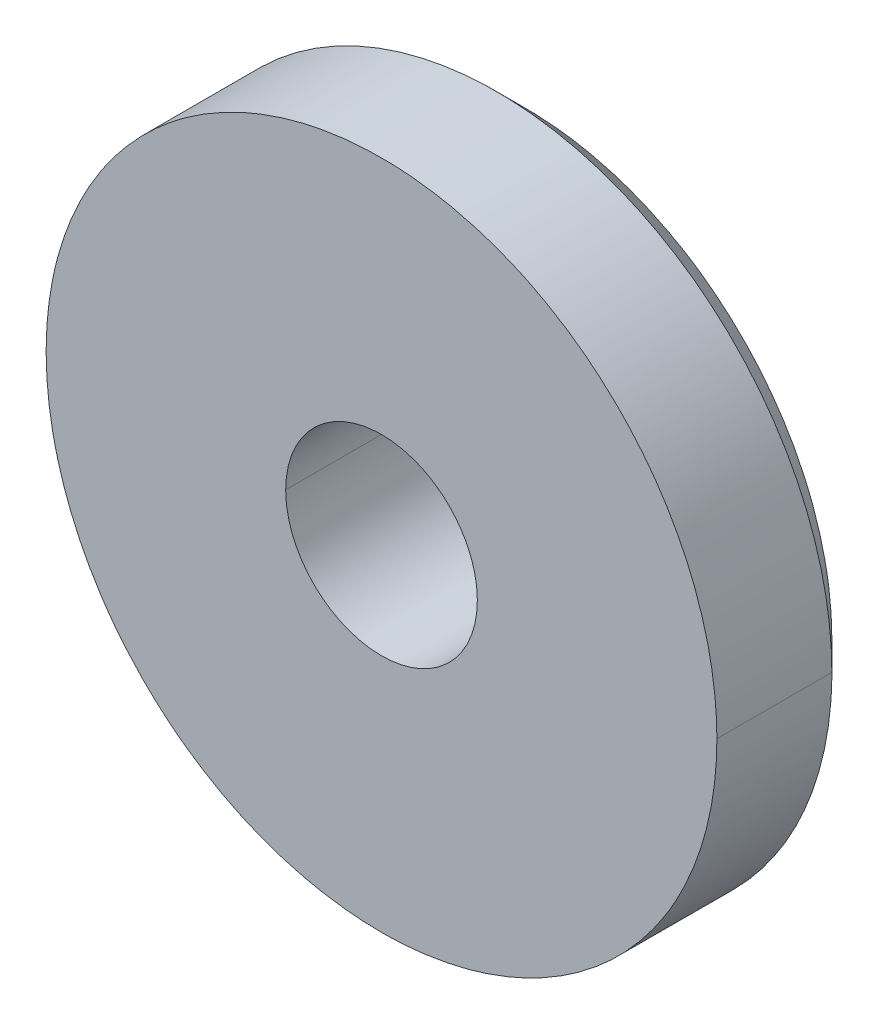
ISO-10303-21;
HEADER;
FILE_DESCRIPTION(('STEP AP214'),'2;1');
FILE_NAME('part.step','',(''),(''),'','','');
FILE_SCHEMA(('AUTOMOTIVE_DESIGN { 1 0 10303 214 1 1 1 1 }'));
ENDSEC;
DATA;
#1=APPLICATION_CONTEXT('core data for automotive mechanical design processes');
#2=APPLICATION_PROTOCOL_DEFINITION('international standard','automotive_design',2000,#1);
#3=PRODUCT_CONTEXT('',#1,'mechanical');
#4=PRODUCT('Part','Part','',(#3));
#5=PRODUCT_RELATED_PRODUCT_CATEGORY('part','',(#4));
#6=PRODUCT_DEFINITION_FORMATION('','',#4);
#7=PRODUCT_DEFINITION_CONTEXT('part definition',#1,'design');
#8=PRODUCT_DEFINITION('design','',#6,#7);
#9=PRODUCT_DEFINITION_SHAPE('','',#8);
#10=(LENGTH_UNIT() NAMED_UNIT(*) SI_UNIT(.MILLI.,.METRE.));
#11=(NAMED_UNIT(*) PLANE_ANGLE_UNIT() SI_UNIT($,.RADIAN.));
#12=(NAMED_UNIT(*) SI_UNIT($,.STERADIAN.) SOLID_ANGLE_UNIT());
#13=UNCERTAINTY_MEASURE_WITH_UNIT(LENGTH_MEASURE(1.E-05),#10,'distance_accuracy_value','');
#14=(GEOMETRIC_REPRESENTATION_CONTEXT(3) GLOBAL_UNCERTAINTY_ASSIGNED_CONTEXT((#13)) GLOBAL_UNIT_ASSIGNED_CONTEXT((#10,
#11,#12)) REPRESENTATION_CONTEXT('',''));
#15=CARTESIAN_POINT('',(0.,0.,0.));
#16=DIRECTION('',(0.,0.,1.));
#17=DIRECTION('',(1.,0.,0.));
#18=AXIS2_PLACEMENT_3D('',#15,#16,#17);
#19=CARTESIAN_POINT('',(10.8868969336,-4.1764018894,3.48920000018));
#20=CARTESIAN_POINT('',(10.8868969336,-4.1764018894,3.782));
#21=CARTESIAN_POINT('',(10.8868969336,-3.90810987678,3.48920000018));
#22=CARTESIAN_POINT('',(10.8868969336,-3.90810987678,3.782));
#23=CARTESIAN_POINT('',(10.7818421201,-3.63956754597,3.48920000018));
#24=CARTESIAN_POINT('',(10.7818421201,-3.63956754597,3.782));
#25=CARTESIAN_POINT('',(10.5694809588,-3.42745670286,3.48920000018));
#26=CARTESIAN_POINT('',(10.5694809588,-3.42745670286,3.782));
#27=CARTESIAN_POINT('',(10.0328969336,-3.21734707595,3.48920000018));
#28=CARTESIAN_POINT('',(10.0328969336,-3.21734707595,3.782));
#29=CARTESIAN_POINT('',(9.49631290836,-3.42745670286,3.48920000018));
#30=CARTESIAN_POINT('',(9.49631290836,-3.42745670286,3.782));
#31=CARTESIAN_POINT('',(9.28395174705,-3.63956754597,3.48920000018));
#32=CARTESIAN_POINT('',(9.28395174705,-3.63956754597,3.782));
#33=CARTESIAN_POINT('',(9.17889693359,-3.90810987678,3.48920000018));
#34=CARTESIAN_POINT('',(9.17889693359,-3.90810987678,3.782));
#35=CARTESIAN_POINT('',(9.17889693359,-4.1764018894,3.48920000018));
#36=CARTESIAN_POINT('',(9.17889693359,-4.1764018894,3.782));
#37=B_SPLINE_SURFACE_WITH_KNOTS('',5,1,((#19,#20),(#21,#22),(#23,#24),(#25,#26),(#27,#28),(#29,
#30),(#31,#32),(#33,#34),(#35,#36)),.UNSPECIFIED.,.F.,.F.,.F.,(6,3,6),(2,2),(0.,5.49778714378,
10.9955742876),(0.300000000745,1.5),.UNSPECIFIED.);
#38=DIRECTION('',(0.,0.,1.));
#39=VECTOR('',#38,1.);
#40=CARTESIAN_POINT('',(9.17889693359,-4.1764018894,3.63560000009));
#41=LINE('',#40,#39);
#42=CARTESIAN_POINT('',(9.17889693359,-4.1764018894,3.489200000045));
#43=VERTEX_POINT('',#42);
#44=CARTESIAN_POINT('',(9.17889693359,-4.1764018894,3.782));
#45=VERTEX_POINT('',#44);
#46=EDGE_CURVE('E75',#43,#45,#41,.T.);
#47=CARTESIAN_POINT('',(9.17889693359,-4.1764018894,3.782));
#48=CARTESIAN_POINT('',(9.1788968461694,-4.15235985944562,3.782));
#49=CARTESIAN_POINT('',(9.17990994533691,-4.12832904131958,3.782));
#50=CARTESIAN_POINT('',(9.18395582748908,-4.08043890881535,3.782));
#51=CARTESIAN_POINT('',(9.18698854411785,-4.05657958882852,3.782));
#52=CARTESIAN_POINT('',(9.19909232082522,-3.98556146459147,3.782));
#53=CARTESIAN_POINT('',(9.21116906498144,-3.93887894903747,3.782));
#54=CARTESIAN_POINT('',(9.24298935548476,-3.84825981784746,3.782));
#55=CARTESIAN_POINT('',(9.26272880210373,-3.80432174843615,3.782));
#56=CARTESIAN_POINT('',(9.3092991360481,-3.72038520706849,3.782));
#57=CARTESIAN_POINT('',(9.33612857725198,-3.68038593401064,3.782));
#58=CARTESIAN_POINT('',(9.39611845983409,-3.60543802382516,3.782));
#59=CARTESIAN_POINT('',(9.42928092219787,-3.5704910052385,3.782));
#60=CARTESIAN_POINT('',(9.50099274331696,-3.50664679755722,3.782));
#61=CARTESIAN_POINT('',(9.53954200716781,-3.47774950190119,3.782));
#62=CARTESIAN_POINT('',(9.62103533427206,-3.42677001504506,3.782));
#63=CARTESIAN_POINT('',(9.66398964312181,-3.40470421463178,3.782));
#64=CARTESIAN_POINT('',(9.75296681564455,-3.36814393490239,3.782));
#65=CARTESIAN_POINT('',(9.79898605009083,-3.35364067429222,3.782));
#66=CARTESIAN_POINT('',(9.87707945820086,-3.33611001647814,3.782));
#67=CARTESIAN_POINT('',(9.90867422395629,-3.33086725227736,3.782));
#68=CARTESIAN_POINT('',(9.97225353703094,-3.32395326782138,3.782));
#69=CARTESIAN_POINT('',(10.0042381067352,-3.3222822536602,3.782));
#70=CARTESIAN_POINT('',(10.0842260954729,-3.32259759038582,3.782));
#71=CARTESIAN_POINT('',(10.1322381043473,-3.32683194259491,3.782));
#72=CARTESIAN_POINT('',(10.2268988749132,-3.34332096015035,3.782));
#73=CARTESIAN_POINT('',(10.2735462328523,-3.3555836003539,3.782));
#74=CARTESIAN_POINT('',(10.3640085802533,-3.38774726832448,3.782));
#75=CARTESIAN_POINT('',(10.4078299523462,-3.40763032476163,3.782));
#76=CARTESIAN_POINT('',(10.4915897049965,-3.4545012472007,3.782));
#77=CARTESIAN_POINT('',(10.5315212882688,-3.48150125528685,3.782));
#78=CARTESIAN_POINT('',(10.6063115352315,-3.54182892999676,3.782));
#79=CARTESIAN_POINT('',(10.6411675889247,-3.57515983200744,3.782));
#80=CARTESIAN_POINT('',(10.7047415094042,-3.64713539252712,3.782));
#81=CARTESIAN_POINT('',(10.73346972253,-3.68577091036449,3.782));
#82=CARTESIAN_POINT('',(10.7841092330087,-3.76741756016027,3.782));
#83=CARTESIAN_POINT('',(10.8060020871634,-3.8104401218487,3.782));
#84=CARTESIAN_POINT('',(10.8422207749767,-3.89955177670138,3.782));
#85=CARTESIAN_POINT('',(10.8565507437698,-3.94563917855797,3.782));
#86=CARTESIAN_POINT('',(10.8735494355992,-4.02275840026495,3.782));
#87=CARTESIAN_POINT('',(10.8785545431009,-4.05329550320001,3.782));
#88=CARTESIAN_POINT('',(10.885227902855,-4.11468498411831,3.782));
#89=CARTESIAN_POINT('',(10.8869012402069,-4.14553680930108,3.782));
#90=CARTESIAN_POINT('',(10.8868969336,-4.17640188921999,3.782));
#91=B_SPLINE_CURVE_WITH_KNOTS('',3,(#47,#48,#49,#50,#51,#52,#53,#54,#55,#56,#57,#58,#59,#60,#61,
#62,#63,#64,#65,#66,#67,#68,#69,#70,#71,#72,#73,#74,#75,#76,#77,#78,#79,#80,#81,#82,#83,#84,#85,
#86,#87,#88,#89,#90),.UNSPECIFIED.,.F.,.F.,(4,2,2,2,2,2,2,2,2,2,2,2,2,2,2,2,2,2,2,2,2,4),(0.,
0.0720822714207288,0.144162174646541,0.288074538934495,0.431910012568474,0.575716171195146,
0.719568297977,0.86341789069701,1.00760999342903,1.15163429158194,1.24752587920709,
1.34342299973629,1.48729684855349,1.6313138309792,1.77499324556325,1.91891939329721,
2.06291929298456,2.20667410205743,2.35081350433184,2.49487401410583,2.58753910892514,
2.68006266530655),.UNSPECIFIED.);
#92=CARTESIAN_POINT('',(10.8868969336,-4.17640188931,3.782));
#93=VERTEX_POINT('',#92);
#94=EDGE_CURVE('E23',#45,#93,#91,.T.);
#95=DIRECTION('',(0.,0.,-1.));
#96=VECTOR('',#95,1.);
#97=CARTESIAN_POINT('',(10.8868969336,-4.1764018894,3.63560000009));
#98=LINE('',#97,#96);
#99=CARTESIAN_POINT('',(10.8868969336,-4.1764018894,3.489200000045));
#100=VERTEX_POINT('',#99);
#101=EDGE_CURVE('E65',#93,#100,#98,.T.);
#102=CARTESIAN_POINT('',(10.8868969336,-4.1764018894,3.4892));
#103=CARTESIAN_POINT('',(10.8868969336,-3.90810987678,3.4892));
#104=CARTESIAN_POINT('',(10.7818421201,-3.63956754597,3.4892));
#105=CARTESIAN_POINT('',(10.5694809588,-3.42745670286,3.4892));
#106=CARTESIAN_POINT('',(10.0328969336,-3.21734707595,3.4892));
#107=CARTESIAN_POINT('',(9.49631290836,-3.42745670286,3.4892));
#108=CARTESIAN_POINT('',(9.28395174705,-3.63956754597,3.4892));
#109=CARTESIAN_POINT('',(9.17889693359,-3.90810987678,3.4892));
#110=CARTESIAN_POINT('',(9.17889693359,-4.1764018894,3.4892));
#111=B_SPLINE_CURVE_WITH_KNOTS('',5,(#102,#103,#104,#105,#106,#107,#108,#109,#110),
.UNSPECIFIED.,.F.,.F.,(6,3,6),(0.,157.079632679,314.159265359),.UNSPECIFIED.);
#112=EDGE_CURVE('E74',#43,#100,#111,.F.);
#113=ORIENTED_EDGE('',*,*,#46,.T.);
#114=ORIENTED_EDGE('',*,*,#94,.T.);
#115=ORIENTED_EDGE('',*,*,#101,.T.);
#116=ORIENTED_EDGE('',*,*,#112,.F.);
#117=EDGE_LOOP('',(#113,#114,#115,#116));
#118=FACE_BOUND('',#117,.T.);
#119=ADVANCED_FACE('F16',(#118),#37,.T.);
#120=CARTESIAN_POINT('',(10.8136969336,-4.1764018894,3.416));
#121=CARTESIAN_POINT('',(10.8868969336,-4.1764018894,3.4892));
#122=CARTESIAN_POINT('',(10.8136969336,-3.93110633501,3.416));
#123=CARTESIAN_POINT('',(10.8868969336,-3.90810987678,3.4892));
#124=CARTESIAN_POINT('',(10.7176468184,-3.68558191826,3.416));
#125=CARTESIAN_POINT('',(10.7818421201,-3.63956754597,3.4892));
#126=CARTESIAN_POINT('',(10.5234880424,-3.49165200456,3.416));
#127=CARTESIAN_POINT('',(10.5694809588,-3.42745670286,3.4892));
#128=CARTESIAN_POINT('',(10.0328969336,-3.29955177424,3.416));
#129=CARTESIAN_POINT('',(10.0328969336,-3.21734707595,3.4892));
#130=CARTESIAN_POINT('',(9.54230582481,-3.49165200456,3.416));
#131=CARTESIAN_POINT('',(9.49631290836,-3.42745670286,3.4892));
#132=CARTESIAN_POINT('',(9.34814704875,-3.68558191826,3.416));
#133=CARTESIAN_POINT('',(9.28395174705,-3.63956754597,3.4892));
#134=CARTESIAN_POINT('',(9.25209693359,-3.93110633501,3.416));
#135=CARTESIAN_POINT('',(9.17889693359,-3.90810987678,3.4892));
#136=CARTESIAN_POINT('',(9.25209693359,-4.1764018894,3.416));
#137=CARTESIAN_POINT('',(9.17889693359,-4.1764018894,3.4892));
#138=B_SPLINE_SURFACE_WITH_KNOTS('',5,1,((#120,#121),(#122,#123),(#124,#125),(#126,#127),(#128,
#129),(#130,#131),(#132,#133),(#134,#135),(#136,#137)),.UNSPECIFIED.,.F.,.F.,.F.,(6,3,6),(2,2),
(0.,157.079632679,314.159265359),(-0.212132034356,0.212132034356),.UNSPECIFIED.);
#139=DIRECTION('',(0.707106781186552,0.,0.707106781186543));
#140=VECTOR('',#139,1.);
#141=CARTESIAN_POINT('',(10.8502969336,-4.1764018894,3.4526));
#142=LINE('',#141,#140);
#143=CARTESIAN_POINT('',(10.8136969336,-4.1764018894,3.416));
#144=VERTEX_POINT('',#143);
#145=EDGE_CURVE('E237',#144,#100,#142,.T.);
#146=CARTESIAN_POINT('',(10.8136969336,-4.1764018894,3.416));
#147=CARTESIAN_POINT('',(10.8137185170753,-4.13919038296963,3.416));
#148=CARTESIAN_POINT('',(10.8110453888165,-4.101982644124,3.416));
#149=CARTESIAN_POINT('',(10.800444348183,-4.02835245616821,3.416));
#150=CARTESIAN_POINT('',(10.7925205209713,-3.99192941927084,3.416));
#151=CARTESIAN_POINT('',(10.7715496760496,-3.92057714134505,3.416));
#152=CARTESIAN_POINT('',(10.7585013538142,-3.88564828319739,3.416));
#153=CARTESIAN_POINT('',(10.7275587910365,-3.81799926228958,3.416));
#154=CARTESIAN_POINT('',(10.7096628704837,-3.78527987017463,3.416));
#155=CARTESIAN_POINT('',(10.6657894510699,-3.71713061511618,3.416));
#156=CARTESIAN_POINT('',(10.6389399272447,-3.68225768961952,3.416));
#157=CARTESIAN_POINT('',(10.5797718133799,-3.61748803395344,3.416));
#158=CARTESIAN_POINT('',(10.547450476221,-3.58759381837028,3.416));
#159=CARTESIAN_POINT('',(10.4781767121982,-3.5335790518827,3.416));
#160=CARTESIAN_POINT('',(10.4412139758728,-3.50947171306124,3.416));
#161=CARTESIAN_POINT('',(10.3637668544451,-3.4678201369247,3.416));
#162=CARTESIAN_POINT('',(10.3232830629643,-3.45027479594309,3.416));
#163=CARTESIAN_POINT('',(10.2400022347925,-3.42227453740156,3.416));
#164=CARTESIAN_POINT('',(10.1972088350062,-3.41180880427652,3.416));
#165=CARTESIAN_POINT('',(10.1104695214222,-3.39821742108779,3.416));
#166=CARTESIAN_POINT('',(10.0665235082594,-3.39509240597443,3.416));
#167=CARTESIAN_POINT('',(9.97874276594101,-3.39624593110745,3.416));
#168=CARTESIAN_POINT('',(9.93490800553944,-3.40052209048901,3.416));
#169=CARTESIAN_POINT('',(9.84858328228334,-3.41638230769544,3.416));
#170=CARTESIAN_POINT('',(9.80609321168452,-3.42796577845164,3.416));
#171=CARTESIAN_POINT('',(9.72367709070509,-3.45810489267687,3.416));
#172=CARTESIAN_POINT('',(9.68375030399532,-3.47665852330911,3.416));
#173=CARTESIAN_POINT('',(9.60757255319158,-3.52020136093443,3.416));
#174=CARTESIAN_POINT('',(9.57132184634857,-3.54519101788614,3.416));
#175=CARTESIAN_POINT('',(9.50349461624721,-3.60090811493393,3.416));
#176=CARTESIAN_POINT('',(9.47192138817908,-3.63163956587009,3.416));
#177=CARTESIAN_POINT('',(9.41437274119644,-3.69796006812468,3.416));
#178=CARTESIAN_POINT('',(9.38839717483011,-3.73354899144876,3.416));
#179=CARTESIAN_POINT('',(9.34274782223926,-3.80864381235384,3.416));
#180=CARTESIAN_POINT('',(9.32308514885302,-3.84815645871741,3.416));
#181=CARTESIAN_POINT('',(9.29070454180463,-3.92992204989464,3.416));
#182=CARTESIAN_POINT('',(9.27798237344737,-3.97217330611872,3.416));
#183=CARTESIAN_POINT('',(9.26331463746116,-4.04167488302973,3.416));
#184=CARTESIAN_POINT('',(9.25910760773274,-4.06846894754811,3.416));
#185=CARTESIAN_POINT('',(9.25349955387726,-4.12230565017498,3.416));
#186=CARTESIAN_POINT('',(9.25209403201671,-4.14934781970969,3.416));
#187=CARTESIAN_POINT('',(9.25209693359,-4.1764018894,3.416));
#188=B_SPLINE_CURVE_WITH_KNOTS('',3,(#146,#147,#148,#149,#150,#151,#152,#153,#154,#155,#156,
#157,#158,#159,#160,#161,#162,#163,#164,#165,#166,#167,#168,#169,#170,#171,#172,#173,#174,#175,
#176,#177,#178,#179,#180,#181,#182,#183,#184,#185,#186,#187),.UNSPECIFIED.,.F.,.F.,(4,2,2,2,2,2,
2,2,2,2,2,2,2,2,2,2,2,2,2,2,4),(0.,0.111532641547348,0.222978609891189,0.334452967068974,
0.445966006955229,0.57736226753705,0.708824692198415,0.84058446473877,0.972322066543818,
1.10385795463281,1.23540521976712,1.36691017566422,1.49840456781148,1.62986101627396,
1.76132665768004,1.89288447803307,2.02443883250809,2.15622351355461,2.28792769701888,
2.36916021894857,2.45026221921367),.UNSPECIFIED.);
#189=CARTESIAN_POINT('',(9.25209693359,-4.1764018894,3.416));
#190=VERTEX_POINT('',#189);
#191=EDGE_CURVE('E153',#144,#190,#188,.T.);
#192=DIRECTION('',(0.707106781186552,0.,-0.707106781186543));
#193=VECTOR('',#192,1.);
#194=CARTESIAN_POINT('',(9.21549693359,-4.1764018894,3.4526));
#195=LINE('',#194,#193);
#196=EDGE_CURVE('E235',#43,#190,#195,.T.);
#197=ORIENTED_EDGE('',*,*,#145,.F.);
#198=ORIENTED_EDGE('',*,*,#191,.T.);
#199=ORIENTED_EDGE('',*,*,#196,.F.);
#200=ORIENTED_EDGE('',*,*,#112,.T.);
#201=EDGE_LOOP('',(#197,#198,#199,#200));
#202=FACE_BOUND('',#201,.T.);
#203=ADVANCED_FACE('F162',(#202),#138,.T.);
#204=CARTESIAN_POINT('',(9.25209693359,-4.1764018894,3.416));
#205=CARTESIAN_POINT('',(9.17889693359,-4.1764018894,3.4892));
#206=CARTESIAN_POINT('',(9.25209693359,-4.42169744379,3.416));
#207=CARTESIAN_POINT('',(9.17889693359,-4.44469390202,3.4892));
#208=CARTESIAN_POINT('',(9.34814704875,-4.66722186054,3.416));
#209=CARTESIAN_POINT('',(9.28395174705,-4.71323623283,3.4892));
#210=CARTESIAN_POINT('',(9.54230582481,-4.86115177424,3.416));
#211=CARTESIAN_POINT('',(9.49631290836,-4.92534707595,3.4892));
#212=CARTESIAN_POINT('',(10.0328969336,-5.05325200456,3.416));
#213=CARTESIAN_POINT('',(10.0328969336,-5.13545670286,3.4892));
#214=CARTESIAN_POINT('',(10.5234880424,-4.86115177424,3.416));
#215=CARTESIAN_POINT('',(10.5694809588,-4.92534707595,3.4892));
#216=CARTESIAN_POINT('',(10.7176468184,-4.66722186054,3.416));
#217=CARTESIAN_POINT('',(10.7818421201,-4.71323623283,3.4892));
#218=CARTESIAN_POINT('',(10.8136969336,-4.42169744379,3.416));
#219=CARTESIAN_POINT('',(10.8868969336,-4.44469390202,3.4892));
#220=CARTESIAN_POINT('',(10.8136969336,-4.1764018894,3.416));
#221=CARTESIAN_POINT('',(10.8868969336,-4.1764018894,3.4892));
#222=B_SPLINE_SURFACE_WITH_KNOTS('',5,1,((#204,#205),(#206,#207),(#208,#209),(#210,#211),(#212,
#213),(#214,#215),(#216,#217),(#218,#219),(#220,#221)),.UNSPECIFIED.,.F.,.F.,.F.,(6,3,6),(2,2),
(314.159265359,471.238898038,628.318530718),(-0.212132034358,0.212132034358),.UNSPECIFIED.);
#223=CARTESIAN_POINT('',(9.25209693359,-4.1764018894,3.416));
#224=CARTESIAN_POINT('',(9.25207535011454,-4.21361339583258,3.416));
#225=CARTESIAN_POINT('',(9.25474847837267,-4.25082113468064,3.416));
#226=CARTESIAN_POINT('',(9.26534951900513,-4.32445132264153,3.416));
#227=CARTESIAN_POINT('',(9.27327334621648,-4.36087435954157,3.416));
#228=CARTESIAN_POINT('',(9.2942441911388,-4.43222663747271,3.416));
#229=CARTESIAN_POINT('',(9.30729251337527,-4.46715549562303,3.416));
#230=CARTESIAN_POINT('',(9.33823507615669,-4.53480451653521,3.416));
#231=CARTESIAN_POINT('',(9.35613099671217,-4.56752390865187,3.416));
#232=CARTESIAN_POINT('',(9.40000441612727,-4.63567316370421,3.416));
#233=CARTESIAN_POINT('',(9.4268539399499,-4.67054608919375,3.416));
#234=CARTESIAN_POINT('',(9.48602205380788,-4.73531574484688,3.416));
#235=CARTESIAN_POINT('',(9.51834339096247,-4.76520996042419,3.416));
#236=CARTESIAN_POINT('',(9.58761715497899,-4.81922472690568,3.416));
#237=CARTESIAN_POINT('',(9.62457989130302,-4.84333206572617,3.416));
#238=CARTESIAN_POINT('',(9.70202701272728,-4.88498364186214,3.416));
#239=CARTESIAN_POINT('',(9.74251080420601,-4.90252898284416,3.416));
#240=CARTESIAN_POINT('',(9.82579163237973,-4.93052924138992,3.416));
#241=CARTESIAN_POINT('',(9.86858503217044,-4.94099497451773,3.416));
#242=CARTESIAN_POINT('',(9.95532434576364,-4.95458635771054,3.416));
#243=CARTESIAN_POINT('',(9.99927035893135,-4.95771137282521,3.416));
#244=CARTESIAN_POINT('',(10.0870511012562,-4.95655784769321,3.416));
#245=CARTESIAN_POINT('',(10.1308858616594,-4.95228168831191,3.416));
#246=CARTESIAN_POINT('',(10.2172105849186,-4.93642147110527,3.416));
#247=CARTESIAN_POINT('',(10.2597006555189,-4.9248380003486,3.416));
#248=CARTESIAN_POINT('',(10.3421167764979,-4.89469888612228,3.416));
#249=CARTESIAN_POINT('',(10.3820435632058,-4.87614525548991,3.416));
#250=CARTESIAN_POINT('',(10.4582213140056,-4.83260241786413,3.416));
#251=CARTESIAN_POINT('',(10.4944720208464,-4.80761276091211,3.416));
#252=CARTESIAN_POINT('',(10.5622992509407,-4.75189566386599,3.416));
#253=CARTESIAN_POINT('',(10.5938724790042,-4.72116421293225,3.416));
#254=CARTESIAN_POINT('',(10.6514211259792,-4.65484371068394,3.416));
#255=CARTESIAN_POINT('',(10.6773966923424,-4.6192547873637,3.416));
#256=CARTESIAN_POINT('',(10.723046044933,-4.54415996646191,3.416));
#257=CARTESIAN_POINT('',(10.7427087183211,-4.50464732009717,3.416));
#258=CARTESIAN_POINT('',(10.775089325374,-4.42288172891772,3.416));
#259=CARTESIAN_POINT('',(10.7878114937338,-4.3806304726926,3.416));
#260=CARTESIAN_POINT('',(10.8024792297242,-4.31112889577885,3.416));
#261=CARTESIAN_POINT('',(10.8066862594542,-4.28433483125895,3.416));
#262=CARTESIAN_POINT('',(10.812294313312,-4.23049812862873,3.416));
#263=CARTESIAN_POINT('',(10.8136998351733,-4.2034559590922,3.416));
#264=CARTESIAN_POINT('',(10.8136969336,-4.1764018894,3.416));
#265=B_SPLINE_CURVE_WITH_KNOTS('',3,(#223,#224,#225,#226,#227,#228,#229,#230,#231,#232,#233,
#234,#235,#236,#237,#238,#239,#240,#241,#242,#243,#244,#245,#246,#247,#248,#249,#250,#251,#252,
#253,#254,#255,#256,#257,#258,#259,#260,#261,#262,#263,#264),.UNSPECIFIED.,.F.,.F.,(4,2,2,2,2,2,
2,2,2,2,2,2,2,2,2,2,2,2,2,2,4),(0.,0.111532641554332,0.222978609905702,0.334452967091895,
0.445966006986198,0.577362267546685,0.708824692187009,0.840584464722445,0.97232206652255,
1.10385795462613,1.23540521977505,1.36691017567679,1.4984045678286,1.62986101628633,
1.76132665768748,1.8928844780258,2.02443883248633,2.15622351353861,2.28792769700826,
2.36916021894314,2.45026221921376),.UNSPECIFIED.);
#266=EDGE_CURVE('E158',#190,#144,#265,.T.);
#267=CARTESIAN_POINT('',(9.17889693359,-4.1764018894,3.4892));
#268=CARTESIAN_POINT('',(9.17889693359,-4.44469390202,3.4892));
#269=CARTESIAN_POINT('',(9.28395174705,-4.71323623283,3.4892));
#270=CARTESIAN_POINT('',(9.49631290836,-4.92534707595,3.4892));
#271=CARTESIAN_POINT('',(10.0328969336,-5.13545670286,3.4892));
#272=CARTESIAN_POINT('',(10.5694809588,-4.92534707595,3.4892));
#273=CARTESIAN_POINT('',(10.7818421201,-4.71323623283,3.4892));
#274=CARTESIAN_POINT('',(10.8868969336,-4.44469390202,3.4892));
#275=CARTESIAN_POINT('',(10.8868969336,-4.1764018894,3.4892));
#276=B_SPLINE_CURVE_WITH_KNOTS('',5,(#267,#268,#269,#270,#271,#272,#273,#274,#275),
.UNSPECIFIED.,.F.,.F.,(6,3,6),(10.9955742876,16.4933614313,21.9911485751),.UNSPECIFIED.);
#277=EDGE_CURVE('E152',#43,#100,#276,.T.);
#278=ORIENTED_EDGE('',*,*,#196,.T.);
#279=ORIENTED_EDGE('',*,*,#266,.T.);
#280=ORIENTED_EDGE('',*,*,#145,.T.);
#281=ORIENTED_EDGE('',*,*,#277,.F.);
#282=EDGE_LOOP('',(#278,#279,#280,#281));
#283=FACE_BOUND('',#282,.T.);
#284=ADVANCED_FACE('F125',(#283),#222,.T.);
#285=CARTESIAN_POINT('',(10.0328969336,-4.1764018894,3.416));
#286=DIRECTION('',(0.,0.,1.));
#287=DIRECTION('',(1.,0.,0.));
#288=AXIS2_PLACEMENT_3D('',#285,#286,#287);
#289=PLANE('',#288);
#290=CARTESIAN_POINT('',(9.78889693359,-4.1764018894,3.416));
#291=CARTESIAN_POINT('',(9.788884913267,-4.19012093923549,3.416));
#292=CARTESIAN_POINT('',(9.79005039179951,-4.20383619845093,3.416));
#293=CARTESIAN_POINT('',(9.79465621620728,-4.23086770919701,3.416));
#294=CARTESIAN_POINT('',(9.7980946400557,-4.24418428791979,3.416));
#295=CARTESIAN_POINT('',(9.80716884794322,-4.270058246589,3.416));
#296=CARTESIAN_POINT('',(9.81280578299939,-4.28261522486698,3.416));
#297=CARTESIAN_POINT('',(9.82609130562548,-4.30659555905113,3.416));
#298=CARTESIAN_POINT('',(9.83373958242569,-4.31801908970953,3.416));
#299=CARTESIAN_POINT('',(9.85941735126965,-4.35010183505214,3.416));
#300=CARTESIAN_POINT('',(9.88020997423685,-4.36865718632701,3.416));
#301=CARTESIAN_POINT('',(9.92676711079218,-4.39782728896549,3.416));
#302=CARTESIAN_POINT('',(9.95254032145996,-4.40842798948508,3.416));
#303=CARTESIAN_POINT('',(10.0060856635661,-4.42047276792773,3.416));
#304=CARTESIAN_POINT('',(10.0338526404073,-4.42193965494866,3.416));
#305=CARTESIAN_POINT('',(10.0883486999684,-4.41559851541482,3.416));
#306=CARTESIAN_POINT('',(10.1150762350485,-4.40777716734336,3.416));
#307=CARTESIAN_POINT('',(10.1643777337137,-4.38375596128705,3.416));
#308=CARTESIAN_POINT('',(10.1869591375867,-4.36757131451459,3.416));
#309=CARTESIAN_POINT('',(10.2255746328621,-4.32855571907697,3.416));
#310=CARTESIAN_POINT('',(10.241593672553,-4.30570969460154,3.416));
#311=CARTESIAN_POINT('',(10.2592596291857,-4.26853837038081,3.416));
#312=CARTESIAN_POINT('',(10.2640912700411,-4.25563392045497,3.416));
#313=CARTESIAN_POINT('',(10.271513341884,-4.22919984684065,3.416));
#314=CARTESIAN_POINT('',(10.2741071526719,-4.21567119855378,3.416));
#315=CARTESIAN_POINT('',(10.2764503364592,-4.19351404632367,3.416));
#316=CARTESIAN_POINT('',(10.2769023466028,-4.18495471908643,3.416));
#317=CARTESIAN_POINT('',(10.2768969336,-4.1764018894,3.416));
#318=B_SPLINE_CURVE_WITH_KNOTS('',3,(#290,#291,#292,#293,#294,#295,#296,#297,#298,#299,#300,
#301,#302,#303,#304,#305,#306,#307,#308,#309,#310,#311,#312,#313,#314,#315,#316,#317),
.UNSPECIFIED.,.F.,.F.,(4,2,2,2,2,2,2,2,2,2,2,2,2,4),(0.,0.0411014434320387,0.0821681754283829,
0.123256436584376,0.164338352974742,0.246247380871461,0.328300751906217,0.410149135566379,
0.492115050999815,0.573932408390357,0.655936388730142,0.69711238282376,0.738226079296546,
0.763888788672388),.UNSPECIFIED.);
#319=CARTESIAN_POINT('',(9.78889693359,-4.1764018894,3.416));
#320=VERTEX_POINT('',#319);
#321=CARTESIAN_POINT('',(10.2768969336,-4.1764018894,3.416));
#322=VERTEX_POINT('',#321);
#323=EDGE_CURVE('E114',#320,#322,#318,.T.);
#324=ORIENTED_EDGE('',*,*,#323,.T.);
#325=CARTESIAN_POINT('',(10.2768969336,-4.1764018894,3.416));
#326=CARTESIAN_POINT('',(10.2769100798835,-4.16268360315365,3.416));
#327=CARTESIAN_POINT('',(10.2757440527256,-4.14896809056076,3.416));
#328=CARTESIAN_POINT('',(10.2711371316046,-4.12193589783553,3.416));
#329=CARTESIAN_POINT('',(10.2676981313133,-4.10861889533982,3.416));
#330=CARTESIAN_POINT('',(10.2586260333558,-4.082745893397,3.416));
#331=CARTESIAN_POINT('',(10.2529917466395,-4.07019031062997,3.416));
#332=CARTESIAN_POINT('',(10.2396982494761,-4.04620529011607,3.416));
#333=CARTESIAN_POINT('',(10.23203945063,-4.03477562410808,3.416));
#334=CARTESIAN_POINT('',(10.2149112332945,-4.01335605873425,3.416));
#335=CARTESIAN_POINT('',(10.2054409899893,-4.00336681889439,3.416));
#336=CARTESIAN_POINT('',(10.1849610952349,-3.98511584178628,3.416));
#337=CARTESIAN_POINT('',(10.1739514130192,-3.97685413905198,3.416));
#338=CARTESIAN_POINT('',(10.150672514778,-3.96227727276992,3.416));
#339=CARTESIAN_POINT('',(10.1384003593909,-3.95596679542029,3.416));
#340=CARTESIAN_POINT('',(10.1129894357766,-3.94550901998658,3.416));
#341=CARTESIAN_POINT('',(10.0998517212541,-3.94135914453031,3.416));
#342=CARTESIAN_POINT('',(10.0688962202465,-3.93440038717015,3.416));
#343=CARTESIAN_POINT('',(10.0508879530814,-3.93240353539837,3.416));
#344=CARTESIAN_POINT('',(10.0191853566605,-3.93240063492783,3.416));
#345=CARTESIAN_POINT('',(10.0054837980212,-3.93355829377728,3.416));
#346=CARTESIAN_POINT('',(9.97846019575755,-3.93815026370243,3.416));
#347=CARTESIAN_POINT('',(9.96513855582448,-3.94158690876641,3.416));
#348=CARTESIAN_POINT('',(9.92636976125688,-3.95519989173689,3.416));
#349=CARTESIAN_POINT('',(9.90200215303907,-3.96868013331278,3.416));
#350=CARTESIAN_POINT('',(9.85911289835371,-4.00297452462838,3.416));
#351=CARTESIAN_POINT('',(9.84059431213812,-4.02379250151347,3.416));
#352=CARTESIAN_POINT('',(9.81875524887033,-4.05864156394019,3.416));
#353=CARTESIAN_POINT('',(9.81245649788257,-4.07089948705544,3.416));
#354=CARTESIAN_POINT('',(9.80200557164717,-4.09631029666792,3.416));
#355=CARTESIAN_POINT('',(9.797852287731,-4.10946271694988,3.416));
#356=CARTESIAN_POINT('',(9.79286171514912,-4.13164699658274,3.416));
#357=CARTESIAN_POINT('',(9.79137514788826,-4.14053928647357,3.416));
#358=CARTESIAN_POINT('',(9.78939303444644,-4.15842031611086,3.416));
#359=CARTESIAN_POINT('',(9.78889602191165,-4.16740889327307,3.416));
#360=CARTESIAN_POINT('',(9.78889693359,-4.1764018894,3.416));
#361=B_SPLINE_CURVE_WITH_KNOTS('',3,(#325,#326,#327,#328,#329,#330,#331,#332,#333,#334,#335,
#336,#337,#338,#339,#340,#341,#342,#343,#344,#345,#346,#347,#348,#349,#350,#351,#352,#353,#354,
#355,#356,#357,#358,#359,#360),.UNSPECIFIED.,.F.,.F.,(4,2,2,2,2,2,2,2,2,2,2,2,2,2,2,2,2,4),(0.,
0.0411011873921077,0.0821681754308235,0.123257437896038,0.164338352970576,0.205438018385913,
0.246538505316624,0.287736948772886,0.328886133535976,0.382765464931995,0.423828763131885,
0.464934180751773,0.546812467499057,0.6287335228834,0.669916143573945,0.711077461833326,
0.738073963082191,0.765030430189959),.UNSPECIFIED.);
#362=EDGE_CURVE('E146',#322,#320,#361,.T.);
#363=ORIENTED_EDGE('',*,*,#362,.T.);
#364=EDGE_LOOP('',(#324,#363));
#365=FACE_BOUND('',#364,.T.);
#366=ORIENTED_EDGE('',*,*,#266,.F.);
#367=ORIENTED_EDGE('',*,*,#191,.F.);
#368=EDGE_LOOP('',(#366,#367));
#369=FACE_BOUND('',#368,.T.);
#370=ADVANCED_FACE('F104',(#365,#369),#289,.F.);
#371=CARTESIAN_POINT('',(9.17889693359,-4.1764018894,3.4892));
#372=CARTESIAN_POINT('',(9.17889693359,-4.1764018894,3.782));
#373=CARTESIAN_POINT('',(9.17889693359,-4.44469390202,3.4892));
#374=CARTESIAN_POINT('',(9.17889693359,-4.44469390202,3.782));
#375=CARTESIAN_POINT('',(9.28395174705,-4.71323623283,3.4892));
#376=CARTESIAN_POINT('',(9.28395174705,-4.71323623283,3.782));
#377=CARTESIAN_POINT('',(9.49631290836,-4.92534707595,3.4892));
#378=CARTESIAN_POINT('',(9.49631290836,-4.92534707595,3.782));
#379=CARTESIAN_POINT('',(10.0328969336,-5.13545670286,3.4892));
#380=CARTESIAN_POINT('',(10.0328969336,-5.13545670286,3.782));
#381=CARTESIAN_POINT('',(10.5694809588,-4.92534707595,3.4892));
#382=CARTESIAN_POINT('',(10.5694809588,-4.92534707595,3.782));
#383=CARTESIAN_POINT('',(10.7818421201,-4.71323623283,3.4892));
#384=CARTESIAN_POINT('',(10.7818421201,-4.71323623283,3.782));
#385=CARTESIAN_POINT('',(10.8868969336,-4.44469390202,3.4892));
#386=CARTESIAN_POINT('',(10.8868969336,-4.44469390202,3.782));
#387=CARTESIAN_POINT('',(10.8868969336,-4.1764018894,3.4892));
#388=CARTESIAN_POINT('',(10.8868969336,-4.1764018894,3.782));
#389=B_SPLINE_SURFACE_WITH_KNOTS('',5,1,((#371,#372),(#373,#374),(#375,#376),(#377,#378),(#379,
#380),(#381,#382),(#383,#384),(#385,#386),(#387,#388)),.UNSPECIFIED.,.F.,.F.,.F.,(6,3,6),(2,2),
(10.9955742876,16.4933614313,21.9911485751),(0.3,1.5),.UNSPECIFIED.);
#390=CARTESIAN_POINT('',(9.17889693359,-4.1764018894,3.782));
#391=CARTESIAN_POINT('',(9.17889684558347,-4.20044405973131,3.782));
#392=CARTESIAN_POINT('',(9.17990995688614,-4.22447501810186,3.782));
#393=CARTESIAN_POINT('',(9.18395588679274,-4.27236542790231,3.782));
#394=CARTESIAN_POINT('',(9.1869886390232,-4.29622488494237,3.782));
#395=CARTESIAN_POINT('',(9.19909246072154,-4.3672428601086,3.782));
#396=CARTESIAN_POINT('',(9.21116915293335,-4.41392509583082,3.782));
#397=CARTESIAN_POINT('',(9.24298898618022,-4.50454289364686,3.782));
#398=CARTESIAN_POINT('',(9.26272789188456,-4.54847995759995,3.782));
#399=CARTESIAN_POINT('',(9.3092978479869,-4.6324166820958,3.782));
#400=CARTESIAN_POINT('',(9.3361277859785,-4.67241695887286,3.782));
#401=CARTESIAN_POINT('',(9.39611737603609,-4.74736429826666,3.782));
#402=CARTESIAN_POINT('',(9.42927865384913,-4.78231005893666,3.782));
#403=CARTESIAN_POINT('',(9.50098939958061,-4.84615469940186,3.782));
#404=CARTESIAN_POINT('',(9.53953919265343,-4.87505321403051,3.782));
#405=CARTESIAN_POINT('',(9.62101447842749,-4.92602001800315,3.782));
#406=CARTESIAN_POINT('',(9.66394771950902,-4.94807592418381,3.782));
#407=CARTESIAN_POINT('',(9.75291201498003,-4.984643726822,3.782));
#408=CARTESIAN_POINT('',(9.79894281804022,-4.99915623450251,3.782));
#409=CARTESIAN_POINT('',(9.89267407835765,-5.02019166465308,3.782));
#410=CARTESIAN_POINT('',(9.94037012807899,-5.02673424396411,3.782));
#411=CARTESIAN_POINT('',(10.0361816243815,-5.03174183868558,3.782));
#412=CARTESIAN_POINT('',(10.0842970536143,-5.03020718665616,3.782));
#413=CARTESIAN_POINT('',(10.1796627170359,-5.01908083342806,3.782));
#414=CARTESIAN_POINT('',(10.2269115332849,-5.00947695534184,3.782));
#415=CARTESIAN_POINT('',(10.319116442661,-4.98245368947231,3.782));
#416=CARTESIAN_POINT('',(10.3640726378308,-4.96503464987404,3.782));
#417=CARTESIAN_POINT('',(10.4503383118923,-4.92292844022555,3.782));
#418=CARTESIAN_POINT('',(10.4916543022775,-4.89825460509536,3.782));
#419=CARTESIAN_POINT('',(10.5695708954268,-4.84233692419943,3.782));
#420=CARTESIAN_POINT('',(10.6061714736818,-4.81109304428713,3.782));
#421=CARTESIAN_POINT('',(10.6737071009517,-4.74284207196058,3.782));
#422=CARTESIAN_POINT('',(10.7046287596968,-4.70582172965435,3.782));
#423=CARTESIAN_POINT('',(10.7598167997122,-4.62711441434612,3.782));
#424=CARTESIAN_POINT('',(10.7840835522767,-4.58542770187578,3.782));
#425=CARTESIAN_POINT('',(10.8252749209524,-4.49854483822463,3.782));
#426=CARTESIAN_POINT('',(10.8421944131139,-4.45334626370073,3.782));
#427=CARTESIAN_POINT('',(10.8681566727868,-4.36078041602012,3.782));
#428=CARTESIAN_POINT('',(10.8772113576966,-4.31341653895818,3.782));
#429=CARTESIAN_POINT('',(10.8837838693233,-4.25085015045374,3.782));
#430=CARTESIAN_POINT('',(10.8849521942881,-4.23597125293323,3.782));
#431=CARTESIAN_POINT('',(10.886507646138,-4.20619752639608,3.782));
#432=CARTESIAN_POINT('',(10.886896072479,-4.1913027653216,3.782));
#433=CARTESIAN_POINT('',(10.8868969336,-4.17640188922,3.782));
#434=B_SPLINE_CURVE_WITH_KNOTS('',3,(#390,#391,#392,#393,#394,#395,#396,#397,#398,#399,#400,
#401,#402,#403,#404,#405,#406,#407,#408,#409,#410,#411,#412,#413,#414,#415,#416,#417,#418,#419,
#420,#421,#422,#423,#424,#425,#426,#427,#428,#429,#430,#431,#432,#433),.UNSPECIFIED.,.F.,.F.,(4,
2,2,2,2,2,2,2,2,2,2,2,2,2,2,2,2,2,2,2,2,4),(0.,0.0720826919124979,0.144163015016611,
0.288074541185675,0.431906632480459,0.575716173480654,0.71956269135309,0.863417892978177,
1.00753193286506,1.15163429372538,1.29538051965008,1.43912082722372,1.58307843689792,
1.72702963353671,1.87071787252785,2.01440685832975,2.15843041506607,2.30244593472094,
2.44656172954632,2.5904587654646,2.63521870822215,2.67990401051048),.UNSPECIFIED.);
#435=EDGE_CURVE('E71',#45,#93,#434,.T.);
#436=ORIENTED_EDGE('',*,*,#101,.F.);
#437=ORIENTED_EDGE('',*,*,#435,.F.);
#438=ORIENTED_EDGE('',*,*,#46,.F.);
#439=ORIENTED_EDGE('',*,*,#277,.T.);
#440=EDGE_LOOP('',(#436,#437,#438,#439));
#441=FACE_BOUND('',#440,.T.);
#442=ADVANCED_FACE('F77',(#441),#389,.T.);
#443=CARTESIAN_POINT('',(10.2768969336,-4.1764018894,3.416));
#444=CARTESIAN_POINT('',(10.2768969336,-4.1764018894,3.782));
#445=CARTESIAN_POINT('',(10.2768969336,-4.09974702865,3.416));
#446=CARTESIAN_POINT('',(10.2768969336,-4.09974702865,3.782));
#447=CARTESIAN_POINT('',(10.2468812726,-4.02302064842,3.416));
#448=CARTESIAN_POINT('',(10.2468812726,-4.02302064842,3.782));
#449=CARTESIAN_POINT('',(10.1862066551,-3.96241755039,3.416));
#450=CARTESIAN_POINT('',(10.1862066551,-3.96241755039,3.782));
#451=CARTESIAN_POINT('',(10.0328969336,-3.90238622841,3.416));
#452=CARTESIAN_POINT('',(10.0328969336,-3.90238622841,3.782));
#453=CARTESIAN_POINT('',(9.8795872121,-3.96241755039,3.416));
#454=CARTESIAN_POINT('',(9.8795872121,-3.96241755039,3.782));
#455=CARTESIAN_POINT('',(9.81891259458,-4.02302064842,3.416));
#456=CARTESIAN_POINT('',(9.81891259458,-4.02302064842,3.782));
#457=CARTESIAN_POINT('',(9.78889693359,-4.09974702865,3.416));
#458=CARTESIAN_POINT('',(9.78889693359,-4.09974702865,3.782));
#459=CARTESIAN_POINT('',(9.78889693359,-4.1764018894,3.416));
#460=CARTESIAN_POINT('',(9.78889693359,-4.1764018894,3.782));
#461=B_SPLINE_SURFACE_WITH_KNOTS('',5,1,((#443,#444),(#445,#446),(#447,#448),(#449,#450),(#451,
#452),(#453,#454),(#455,#456),(#457,#458),(#459,#460)),.UNSPECIFIED.,.F.,.F.,.F.,(6,3,6),(2,2),
(0.,1.57079632679,3.14159265359),(0.,1.5),.UNSPECIFIED.);
#462=DIRECTION('',(0.,0.,1.));
#463=VECTOR('',#462,1.);
#464=CARTESIAN_POINT('',(10.2768969336,-4.1764018894,3.599));
#465=LINE('',#464,#463);
#466=CARTESIAN_POINT('',(10.2768969336,-4.1764018894,3.782));
#467=VERTEX_POINT('',#466);
#468=EDGE_CURVE('E79',#322,#467,#465,.T.);
#469=CARTESIAN_POINT('',(9.78889693359,-4.1764018894,3.782));
#470=CARTESIAN_POINT('',(9.78888378730646,-4.1626836031543,3.782));
#471=CARTESIAN_POINT('',(9.79004981446393,-4.14896809056198,3.782));
#472=CARTESIAN_POINT('',(9.79465673558384,-4.12193589783777,3.782));
#473=CARTESIAN_POINT('',(9.79809573587459,-4.10861889534253,3.782));
#474=CARTESIAN_POINT('',(9.80716783383107,-4.08274589340051,3.782));
#475=CARTESIAN_POINT('',(9.81280212054706,-4.07019031063382,3.782));
#476=CARTESIAN_POINT('',(9.82609561771006,-4.04620529012075,3.782));
#477=CARTESIAN_POINT('',(9.83375441655601,-4.03477562411325,3.782));
#478=CARTESIAN_POINT('',(9.85088263389015,-4.01335605874156,3.782));
#479=CARTESIAN_POINT('',(9.860352877194,-4.00336681890322,3.782));
#480=CARTESIAN_POINT('',(9.88083277194514,-3.98511584179747,3.782));
#481=CARTESIAN_POINT('',(9.89184245415892,-3.97685413906401,3.782));
#482=CARTESIAN_POINT('',(9.91512135239829,-3.96227727278118,3.782));
#483=CARTESIAN_POINT('',(9.92739350778572,-3.95596679543034,3.782));
#484=CARTESIAN_POINT('',(9.95280443140081,-3.94550901999408,3.782));
#485=CARTESIAN_POINT('',(9.96594214592373,-3.94135914453646,3.782));
#486=CARTESIAN_POINT('',(9.99689764693874,-3.93440038717189,3.782));
#487=CARTESIAN_POINT('',(10.0149059141112,-3.93240353539841,3.782));
#488=CARTESIAN_POINT('',(10.0466085105383,-3.9324006349278,3.782));
#489=CARTESIAN_POINT('',(10.0603100691763,-3.93355829377702,3.782));
#490=CARTESIAN_POINT('',(10.0873336714375,-3.93815026370139,3.782));
#491=CARTESIAN_POINT('',(10.1006553113694,-3.94158690876482,3.782));
#492=CARTESIAN_POINT('',(10.1394241059338,-3.95519989173363,3.782));
#493=CARTESIAN_POINT('',(10.1637917141495,-3.96868013330841,3.782));
#494=CARTESIAN_POINT('',(10.2066809688296,-4.00297452462009,3.782));
#495=CARTESIAN_POINT('',(10.2251995550422,-4.02379250150195,3.782));
#496=CARTESIAN_POINT('',(10.2470386183095,-4.05864156392423,3.782));
#497=CARTESIAN_POINT('',(10.253337369298,-4.07089948703915,3.782));
#498=CARTESIAN_POINT('',(10.2637882955354,-4.09631029665095,3.782));
#499=CARTESIAN_POINT('',(10.2679415794527,-4.10946271693257,3.782));
#500=CARTESIAN_POINT('',(10.2729321520374,-4.13164699656793,3.782));
#501=CARTESIAN_POINT('',(10.2744187192995,-4.14053928646161,3.782));
#502=CARTESIAN_POINT('',(10.2764008327431,-4.15842031610478,3.782));
#503=CARTESIAN_POINT('',(10.2768978452783,-4.16740889327002,3.782));
#504=CARTESIAN_POINT('',(10.2768969336,-4.1764018894,3.782));
#505=B_SPLINE_CURVE_WITH_KNOTS('',3,(#469,#470,#471,#472,#473,#474,#475,#476,#477,#478,#479,
#480,#481,#482,#483,#484,#485,#486,#487,#488,#489,#490,#491,#492,#493,#494,#495,#496,#497,#498,
#499,#500,#501,#502,#503,#504),.UNSPECIFIED.,.F.,.F.,(4,2,2,2,2,2,2,2,2,2,2,2,2,2,2,2,2,4),(0.,
0.0411011873902909,0.0821681754272122,0.123257437891028,0.164338352964094,0.205438018373436,
0.246538505298214,0.287736948756996,0.328886133522588,0.382765464940598,0.42382876313677,
0.464934180752863,0.546812467492966,0.628733522865062,0.669916143555819,0.711077461815339,
0.738073963073204,0.765030430190071),.UNSPECIFIED.);
#506=CARTESIAN_POINT('',(9.78889693359,-4.1764018894,3.782));
#507=VERTEX_POINT('',#506);
#508=EDGE_CURVE('E34',#507,#467,#505,.T.);
#509=DIRECTION('',(0.,0.,-1.));
#510=VECTOR('',#509,1.);
#511=CARTESIAN_POINT('',(9.78889693359,-4.1764018894,3.599));
#512=LINE('',#511,#510);
#513=EDGE_CURVE('E151',#507,#320,#512,.T.);
#514=ORIENTED_EDGE('',*,*,#362,.F.);
#515=ORIENTED_EDGE('',*,*,#468,.T.);
#516=ORIENTED_EDGE('',*,*,#508,.F.);
#517=ORIENTED_EDGE('',*,*,#513,.T.);
#518=EDGE_LOOP('',(#514,#515,#516,#517));
#519=FACE_BOUND('',#518,.T.);
#520=ADVANCED_FACE('F124',(#519),#461,.F.);
#521=CARTESIAN_POINT('',(9.78889693359,-4.1764018894,3.416));
#522=CARTESIAN_POINT('',(9.78889693359,-4.1764018894,3.782));
#523=CARTESIAN_POINT('',(9.78889693359,-4.25305675015,3.416));
#524=CARTESIAN_POINT('',(9.78889693359,-4.25305675015,3.782));
#525=CARTESIAN_POINT('',(9.81891259458,-4.32978313038,3.416));
#526=CARTESIAN_POINT('',(9.81891259458,-4.32978313038,3.782));
#527=CARTESIAN_POINT('',(9.8795872121,-4.39038622841,3.416));
#528=CARTESIAN_POINT('',(9.8795872121,-4.39038622841,3.782));
#529=CARTESIAN_POINT('',(10.0328969336,-4.45041755039,3.416));
#530=CARTESIAN_POINT('',(10.0328969336,-4.45041755039,3.782));
#531=CARTESIAN_POINT('',(10.1862066551,-4.39038622841,3.416));
#532=CARTESIAN_POINT('',(10.1862066551,-4.39038622841,3.782));
#533=CARTESIAN_POINT('',(10.2468812726,-4.32978313038,3.416));
#534=CARTESIAN_POINT('',(10.2468812726,-4.32978313038,3.782));
#535=CARTESIAN_POINT('',(10.2768969336,-4.25305675015,3.416));
#536=CARTESIAN_POINT('',(10.2768969336,-4.25305675015,3.782));
#537=CARTESIAN_POINT('',(10.2768969336,-4.1764018894,3.416));
#538=CARTESIAN_POINT('',(10.2768969336,-4.1764018894,3.782));
#539=B_SPLINE_SURFACE_WITH_KNOTS('',5,1,((#521,#522),(#523,#524),(#525,#526),(#527,#528),(#529,
#530),(#531,#532),(#533,#534),(#535,#536),(#537,#538)),.UNSPECIFIED.,.F.,.F.,.F.,(6,3,6),(2,2),
(3.14159265359,4.71238898038,6.28318530718),(0.,1.5),.UNSPECIFIED.);
#540=CARTESIAN_POINT('',(10.2768969336,-4.1764018894,3.782));
#541=CARTESIAN_POINT('',(10.2769089539229,-4.19012093923613,3.782));
#542=CARTESIAN_POINT('',(10.27574347539,-4.2038361984521,3.782));
#543=CARTESIAN_POINT('',(10.2711376509812,-4.23086770919917,3.782));
#544=CARTESIAN_POINT('',(10.2676992271322,-4.24418428792239,3.782));
#545=CARTESIAN_POINT('',(10.2586250192437,-4.27005824659236,3.782));
#546=CARTESIAN_POINT('',(10.2529880841872,-4.28261522487067,3.782));
#547=CARTESIAN_POINT('',(10.2397025615607,-4.3065955590556,3.782));
#548=CARTESIAN_POINT('',(10.2320542847604,-4.31801908971446,3.782));
#549=CARTESIAN_POINT('',(10.206376515914,-4.35010183506077,3.782));
#550=CARTESIAN_POINT('',(10.1855838929436,-4.36865718633832,3.782));
#551=CARTESIAN_POINT('',(10.1390267563847,-4.39782728897525,3.782));
#552=CARTESIAN_POINT('',(10.1132535457176,-4.40842798949221,3.782));
#553=CARTESIAN_POINT('',(10.0597082036158,-4.42047276792941,3.782));
#554=CARTESIAN_POINT('',(10.0319412267784,-4.42193965494818,3.782));
#555=CARTESIAN_POINT('',(9.97744516722174,-4.41559851541257,3.782));
#556=CARTESIAN_POINT('',(9.95071763214255,-4.40777716734041,3.782));
#557=CARTESIAN_POINT('',(9.90141613347538,-4.38375596128312,3.782));
#558=CARTESIAN_POINT('',(9.87883472959999,-4.36757131450945,3.782));
#559=CARTESIAN_POINT('',(9.84021923432033,-4.32855571906763,3.782));
#560=CARTESIAN_POINT('',(9.82420019462758,-4.30570969458904,3.782));
#561=CARTESIAN_POINT('',(9.8065342379963,-4.26853837036522,3.782));
#562=CARTESIAN_POINT('',(9.80170259714224,-4.25563392044009,3.782));
#563=CARTESIAN_POINT('',(9.79428052530207,-4.22919984682737,3.782));
#564=CARTESIAN_POINT('',(9.79168671451554,-4.2156711985414,3.782));
#565=CARTESIAN_POINT('',(9.78934353073021,-4.19351404631603,3.782));
#566=CARTESIAN_POINT('',(9.78889152058718,-4.1849547190826,3.782));
#567=CARTESIAN_POINT('',(9.78889693359,-4.1764018894,3.782));
#568=B_SPLINE_CURVE_WITH_KNOTS('',3,(#540,#541,#542,#543,#544,#545,#546,#547,#548,#549,#550,
#551,#552,#553,#554,#555,#556,#557,#558,#559,#560,#561,#562,#563,#564,#565,#566,#567),
.UNSPECIFIED.,.F.,.F.,(4,2,2,2,2,2,2,2,2,2,2,2,2,4),(0.,0.0411014434337881,0.082168175431862,
0.12325643658919,0.164338352980961,0.246247380889211,0.328300751918933,0.410149135568066,
0.492115051000073,0.573932408398472,0.655936388748168,0.697112382838335,0.738226079307778,
0.76388878867218),.UNSPECIFIED.);
#569=EDGE_CURVE('E11',#467,#507,#568,.T.);
#570=ORIENTED_EDGE('',*,*,#323,.F.);
#571=ORIENTED_EDGE('',*,*,#513,.F.);
#572=ORIENTED_EDGE('',*,*,#569,.F.);
#573=ORIENTED_EDGE('',*,*,#468,.F.);
#574=EDGE_LOOP('',(#570,#571,#572,#573));
#575=FACE_BOUND('',#574,.T.);
#576=ADVANCED_FACE('F18',(#575),#539,.F.);
#577=CARTESIAN_POINT('',(10.0328969336,-4.1764018894,3.782));
#578=DIRECTION('',(0.,0.,1.));
#579=DIRECTION('',(1.,0.,0.));
#580=AXIS2_PLACEMENT_3D('',#577,#578,#579);
#581=PLANE('',#580);
#582=ORIENTED_EDGE('',*,*,#508,.T.);
#583=ORIENTED_EDGE('',*,*,#569,.T.);
#584=EDGE_LOOP('',(#582,#583));
#585=FACE_BOUND('',#584,.T.);
#586=ORIENTED_EDGE('',*,*,#435,.T.);
#587=ORIENTED_EDGE('',*,*,#94,.F.);
#588=EDGE_LOOP('',(#586,#587));
#589=FACE_BOUND('',#588,.T.);
#590=ADVANCED_FACE('F70',(#585,#589),#581,.T.);
#591=CLOSED_SHELL('',(#119,#203,#284,#370,#442,#520,#576,#590));
#592=MANIFOLD_SOLID_BREP('B1',#591);
#593=ADVANCED_BREP_SHAPE_REPRESENTATION('',(#18,#592),#14);
#594=SHAPE_DEFINITION_REPRESENTATION(#9,#593);
ENDSEC;
END-ISO-10303-21;
